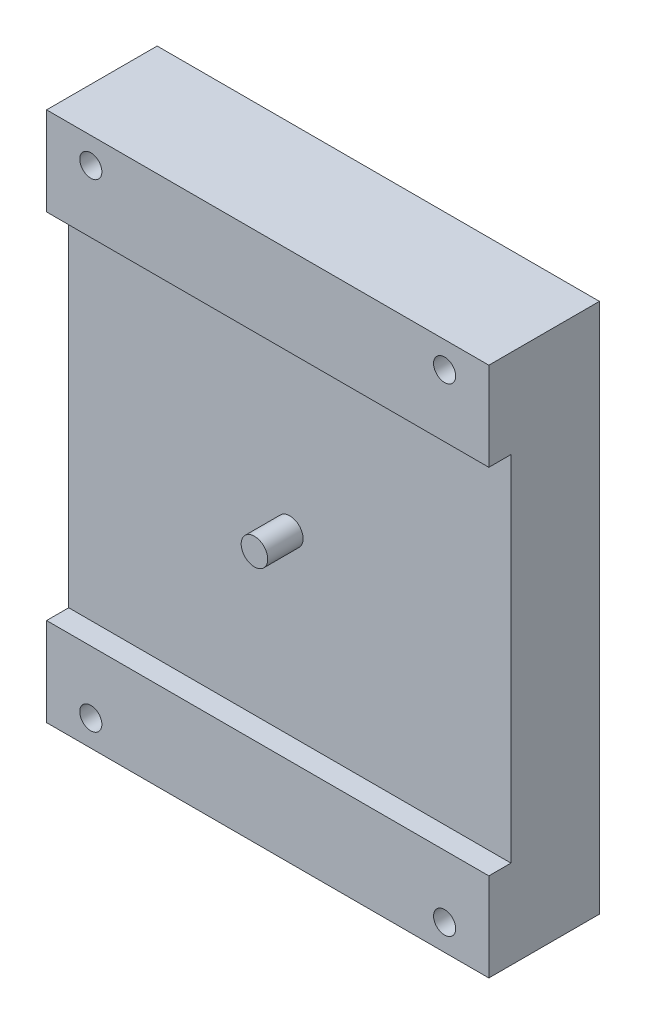
ISO-10303-21;
HEADER;
FILE_DESCRIPTION(('STEP AP214'),'2;1');
FILE_NAME('part.step','',(''),(''),'','','');
FILE_SCHEMA(('AUTOMOTIVE_DESIGN { 1 0 10303 214 1 1 1 1 }'));
ENDSEC;
DATA;
#1=APPLICATION_CONTEXT('core data for automotive mechanical design processes');
#2=APPLICATION_PROTOCOL_DEFINITION('international standard','automotive_design',2000,#1);
#3=PRODUCT_CONTEXT('',#1,'mechanical');
#4=PRODUCT('Part','Part','',(#3));
#5=PRODUCT_RELATED_PRODUCT_CATEGORY('part','',(#4));
#6=PRODUCT_DEFINITION_FORMATION('','',#4);
#7=PRODUCT_DEFINITION_CONTEXT('part definition',#1,'design');
#8=PRODUCT_DEFINITION('design','',#6,#7);
#9=PRODUCT_DEFINITION_SHAPE('','',#8);
#10=(LENGTH_UNIT() NAMED_UNIT(*) SI_UNIT(.MILLI.,.METRE.));
#11=(NAMED_UNIT(*) PLANE_ANGLE_UNIT() SI_UNIT($,.RADIAN.));
#12=(NAMED_UNIT(*) SI_UNIT($,.STERADIAN.) SOLID_ANGLE_UNIT());
#13=UNCERTAINTY_MEASURE_WITH_UNIT(LENGTH_MEASURE(1.E-05),#10,'distance_accuracy_value','');
#14=(GEOMETRIC_REPRESENTATION_CONTEXT(3) GLOBAL_UNCERTAINTY_ASSIGNED_CONTEXT((#13)) GLOBAL_UNIT_ASSIGNED_CONTEXT((#10,
#11,#12)) REPRESENTATION_CONTEXT('',''));
#15=CARTESIAN_POINT('',(0.,0.,0.));
#16=DIRECTION('',(0.,0.,1.));
#17=DIRECTION('',(1.,0.,0.));
#18=AXIS2_PLACEMENT_3D('',#15,#16,#17);
#19=CARTESIAN_POINT('',(0.,0.,10.));
#20=DIRECTION('',(0.,0.,1.));
#21=DIRECTION('',(1.,0.,0.));
#22=AXIS2_PLACEMENT_3D('',#19,#20,#21);
#23=PLANE('',#22);
#24=CARTESIAN_POINT('',(-25.,30.,10.));
#25=DIRECTION('',(0.,0.,1.));
#26=DIRECTION('',(1.,0.,0.));
#27=AXIS2_PLACEMENT_3D('',#24,#25,#26);
#28=CIRCLE('',#27,1.5);
#29=CARTESIAN_POINT('',(-23.5,30.,10.));
#30=VERTEX_POINT('',#29);
#31=EDGE_CURVE('E150',#30,#30,#28,.T.);
#32=ORIENTED_EDGE('',*,*,#31,.F.);
#33=EDGE_LOOP('',(#32));
#34=FACE_BOUND('',#33,.T.);
#35=DIRECTION('',(0.,-1.,0.));
#36=VECTOR('',#35,1.);
#37=CARTESIAN_POINT('',(-50.,0.,10.));
#38=LINE('',#37,#36);
#39=CARTESIAN_POINT('',(-50.,50.,10.));
#40=VERTEX_POINT('',#39);
#41=CARTESIAN_POINT('',(-50.,9.99999999999999,10.));
#42=VERTEX_POINT('',#41);
#43=EDGE_CURVE('E53',#40,#42,#38,.T.);
#44=ORIENTED_EDGE('',*,*,#43,.T.);
#45=DIRECTION('',(-1.,0.,0.));
#46=VECTOR('',#45,1.);
#47=CARTESIAN_POINT('',(0.,10.,10.));
#48=LINE('',#47,#46);
#49=CARTESIAN_POINT('',(0.,10.,10.));
#50=VERTEX_POINT('',#49);
#51=EDGE_CURVE('E48',#50,#42,#48,.T.);
#52=ORIENTED_EDGE('',*,*,#51,.F.);
#53=DIRECTION('',(0.,1.,0.));
#54=VECTOR('',#53,1.);
#55=CARTESIAN_POINT('',(0.,0.,10.));
#56=LINE('',#55,#54);
#57=CARTESIAN_POINT('',(0.,50.,10.));
#58=VERTEX_POINT('',#57);
#59=EDGE_CURVE('E120',#50,#58,#56,.T.);
#60=ORIENTED_EDGE('',*,*,#59,.T.);
#61=DIRECTION('',(1.,0.,0.));
#62=VECTOR('',#61,1.);
#63=CARTESIAN_POINT('',(-50.,50.,10.));
#64=LINE('',#63,#62);
#65=EDGE_CURVE('E131',#40,#58,#64,.T.);
#66=ORIENTED_EDGE('',*,*,#65,.F.);
#67=EDGE_LOOP('',(#44,#52,#60,#66));
#68=FACE_BOUND('',#67,.T.);
#69=ADVANCED_FACE('F33',(#34,#68),#23,.T.);
#70=CARTESIAN_POINT('',(0.,0.,0.));
#71=DIRECTION('',(0.,0.,1.));
#72=DIRECTION('',(1.,0.,0.));
#73=AXIS2_PLACEMENT_3D('',#70,#71,#72);
#74=PLANE('',#73);
#75=DIRECTION('',(0.,1.,0.));
#76=VECTOR('',#75,1.);
#77=CARTESIAN_POINT('',(0.,0.,0.));
#78=LINE('',#77,#76);
#79=CARTESIAN_POINT('',(0.,0.,0.));
#80=VERTEX_POINT('',#79);
#81=CARTESIAN_POINT('',(0.,60.,0.));
#82=VERTEX_POINT('',#81);
#83=EDGE_CURVE('E168',#80,#82,#78,.T.);
#84=ORIENTED_EDGE('',*,*,#83,.F.);
#85=DIRECTION('',(1.,0.,0.));
#86=VECTOR('',#85,1.);
#87=CARTESIAN_POINT('',(0.,0.,0.));
#88=LINE('',#87,#86);
#89=CARTESIAN_POINT('',(-50.,0.,0.));
#90=VERTEX_POINT('',#89);
#91=EDGE_CURVE('E170',#90,#80,#88,.T.);
#92=ORIENTED_EDGE('',*,*,#91,.F.);
#93=DIRECTION('',(0.,-1.,0.));
#94=VECTOR('',#93,1.);
#95=CARTESIAN_POINT('',(-50.,0.,0.));
#96=LINE('',#95,#94);
#97=CARTESIAN_POINT('',(-50.,60.,0.));
#98=VERTEX_POINT('',#97);
#99=EDGE_CURVE('E176',#98,#90,#96,.T.);
#100=ORIENTED_EDGE('',*,*,#99,.F.);
#101=DIRECTION('',(-1.,0.,0.));
#102=VECTOR('',#101,1.);
#103=CARTESIAN_POINT('',(0.,60.,0.));
#104=LINE('',#103,#102);
#105=EDGE_CURVE('E174',#82,#98,#104,.T.);
#106=ORIENTED_EDGE('',*,*,#105,.F.);
#107=EDGE_LOOP('',(#84,#92,#100,#106));
#108=FACE_BOUND('',#107,.T.);
#109=CARTESIAN_POINT('',(-45.,57.05,0.));
#110=DIRECTION('',(0.,0.,1.));
#111=DIRECTION('',(1.,0.,0.));
#112=AXIS2_PLACEMENT_3D('',#109,#110,#111);
#113=CIRCLE('',#112,1.25);
#114=CARTESIAN_POINT('',(-43.75,57.05,0.));
#115=VERTEX_POINT('',#114);
#116=EDGE_CURVE('E165',#115,#115,#113,.T.);
#117=ORIENTED_EDGE('',*,*,#116,.T.);
#118=EDGE_LOOP('',(#117));
#119=FACE_BOUND('',#118,.T.);
#120=CARTESIAN_POINT('',(-5.,57.05,0.));
#121=DIRECTION('',(0.,0.,1.));
#122=DIRECTION('',(1.,0.,0.));
#123=AXIS2_PLACEMENT_3D('',#120,#121,#122);
#124=CIRCLE('',#123,1.25);
#125=CARTESIAN_POINT('',(-3.75,57.05,0.));
#126=VERTEX_POINT('',#125);
#127=EDGE_CURVE('E162',#126,#126,#124,.T.);
#128=ORIENTED_EDGE('',*,*,#127,.T.);
#129=EDGE_LOOP('',(#128));
#130=FACE_BOUND('',#129,.T.);
#131=CARTESIAN_POINT('',(-44.9999999999994,2.94999999999999,0.));
#132=DIRECTION('',(0.,0.,1.));
#133=DIRECTION('',(1.,0.,0.));
#134=AXIS2_PLACEMENT_3D('',#131,#132,#133);
#135=CIRCLE('',#134,1.25);
#136=CARTESIAN_POINT('',(-43.7499999999994,2.94999999999999,0.));
#137=VERTEX_POINT('',#136);
#138=EDGE_CURVE('E159',#137,#137,#135,.T.);
#139=ORIENTED_EDGE('',*,*,#138,.T.);
#140=EDGE_LOOP('',(#139));
#141=FACE_BOUND('',#140,.T.);
#142=CARTESIAN_POINT('',(-4.99999999999944,2.94999999999999,0.));
#143=DIRECTION('',(0.,0.,1.));
#144=DIRECTION('',(1.,0.,0.));
#145=AXIS2_PLACEMENT_3D('',#142,#143,#144);
#146=CIRCLE('',#145,1.25);
#147=CARTESIAN_POINT('',(-3.74999999999944,2.94999999999999,0.));
#148=VERTEX_POINT('',#147);
#149=EDGE_CURVE('E154',#148,#148,#146,.T.);
#150=ORIENTED_EDGE('',*,*,#149,.T.);
#151=EDGE_LOOP('',(#150));
#152=FACE_BOUND('',#151,.T.);
#153=ADVANCED_FACE('F193',(#108,#119,#130,#141,#152),#74,.F.);
#154=CARTESIAN_POINT('',(0.,0.,10.));
#155=DIRECTION('',(-1.,0.,0.));
#156=DIRECTION('',(0.,-1.,0.));
#157=AXIS2_PLACEMENT_3D('',#154,#155,#156);
#158=PLANE('',#157);
#159=ORIENTED_EDGE('',*,*,#83,.T.);
#160=DIRECTION('',(0.,0.,-1.));
#161=VECTOR('',#160,1.);
#162=CARTESIAN_POINT('',(0.,60.,10.));
#163=LINE('',#162,#161);
#164=CARTESIAN_POINT('',(0.,60.,12.5));
#165=VERTEX_POINT('',#164);
#166=EDGE_CURVE('E11',#165,#82,#163,.T.);
#167=ORIENTED_EDGE('',*,*,#166,.F.);
#168=DIRECTION('',(0.,1.,0.));
#169=VECTOR('',#168,1.);
#170=CARTESIAN_POINT('',(0.,60.,12.5));
#171=LINE('',#170,#169);
#172=CARTESIAN_POINT('',(0.,50.,12.5));
#173=VERTEX_POINT('',#172);
#174=EDGE_CURVE('E137',#173,#165,#171,.T.);
#175=ORIENTED_EDGE('',*,*,#174,.F.);
#176=DIRECTION('',(0.,0.,-1.));
#177=VECTOR('',#176,1.);
#178=CARTESIAN_POINT('',(0.,50.,12.5));
#179=LINE('',#178,#177);
#180=EDGE_CURVE('E143',#173,#58,#179,.T.);
#181=ORIENTED_EDGE('',*,*,#180,.T.);
#182=ORIENTED_EDGE('',*,*,#59,.F.);
#183=DIRECTION('',(0.,0.,-1.));
#184=VECTOR('',#183,1.);
#185=CARTESIAN_POINT('',(0.,10.,12.5));
#186=LINE('',#185,#184);
#187=CARTESIAN_POINT('',(0.,10.,12.5));
#188=VERTEX_POINT('',#187);
#189=EDGE_CURVE('E100',#188,#50,#186,.T.);
#190=ORIENTED_EDGE('',*,*,#189,.F.);
#191=DIRECTION('',(0.,1.,0.));
#192=VECTOR('',#191,1.);
#193=CARTESIAN_POINT('',(0.,0.,12.5));
#194=LINE('',#193,#192);
#195=CARTESIAN_POINT('',(0.,0.,12.5));
#196=VERTEX_POINT('',#195);
#197=EDGE_CURVE('E107',#196,#188,#194,.T.);
#198=ORIENTED_EDGE('',*,*,#197,.F.);
#199=DIRECTION('',(0.,0.,-1.));
#200=VECTOR('',#199,1.);
#201=CARTESIAN_POINT('',(0.,0.,10.));
#202=LINE('',#201,#200);
#203=EDGE_CURVE('E172',#196,#80,#202,.T.);
#204=ORIENTED_EDGE('',*,*,#203,.T.);
#205=EDGE_LOOP('',(#159,#167,#175,#181,#182,#190,#198,#204));
#206=FACE_BOUND('',#205,.T.);
#207=ADVANCED_FACE('F35',(#206),#158,.F.);
#208=CARTESIAN_POINT('',(0.,60.,10.));
#209=DIRECTION('',(0.,-1.,0.));
#210=DIRECTION('',(1.,0.,0.));
#211=AXIS2_PLACEMENT_3D('',#208,#209,#210);
#212=PLANE('',#211);
#213=ORIENTED_EDGE('',*,*,#105,.T.);
#214=DIRECTION('',(0.,0.,-1.));
#215=VECTOR('',#214,1.);
#216=CARTESIAN_POINT('',(-50.,60.,10.));
#217=LINE('',#216,#215);
#218=CARTESIAN_POINT('',(-50.,60.,12.5));
#219=VERTEX_POINT('',#218);
#220=EDGE_CURVE('E41',#219,#98,#217,.T.);
#221=ORIENTED_EDGE('',*,*,#220,.F.);
#222=DIRECTION('',(-1.,0.,0.));
#223=VECTOR('',#222,1.);
#224=CARTESIAN_POINT('',(-50.,60.,12.5));
#225=LINE('',#224,#223);
#226=EDGE_CURVE('E140',#165,#219,#225,.T.);
#227=ORIENTED_EDGE('',*,*,#226,.F.);
#228=ORIENTED_EDGE('',*,*,#166,.T.);
#229=EDGE_LOOP('',(#213,#221,#227,#228));
#230=FACE_BOUND('',#229,.T.);
#231=ADVANCED_FACE('F202',(#230),#212,.F.);
#232=CARTESIAN_POINT('',(-50.,0.,10.));
#233=DIRECTION('',(1.,0.,0.));
#234=DIRECTION('',(0.,0.,-1.));
#235=AXIS2_PLACEMENT_3D('',#232,#233,#234);
#236=PLANE('',#235);
#237=ORIENTED_EDGE('',*,*,#99,.T.);
#238=DIRECTION('',(0.,0.,-1.));
#239=VECTOR('',#238,1.);
#240=CARTESIAN_POINT('',(-50.,0.,10.));
#241=LINE('',#240,#239);
#242=CARTESIAN_POINT('',(-50.,0.,12.5));
#243=VERTEX_POINT('',#242);
#244=EDGE_CURVE('E180',#243,#90,#241,.T.);
#245=ORIENTED_EDGE('',*,*,#244,.F.);
#246=DIRECTION('',(0.,-1.,0.));
#247=VECTOR('',#246,1.);
#248=CARTESIAN_POINT('',(-50.,0.,12.5));
#249=LINE('',#248,#247);
#250=CARTESIAN_POINT('',(-50.,9.99999999999999,12.5));
#251=VERTEX_POINT('',#250);
#252=EDGE_CURVE('E106',#251,#243,#249,.T.);
#253=ORIENTED_EDGE('',*,*,#252,.F.);
#254=DIRECTION('',(0.,0.,-1.));
#255=VECTOR('',#254,1.);
#256=CARTESIAN_POINT('',(-50.,9.99999999999999,12.5));
#257=LINE('',#256,#255);
#258=EDGE_CURVE('E102',#251,#42,#257,.T.);
#259=ORIENTED_EDGE('',*,*,#258,.T.);
#260=ORIENTED_EDGE('',*,*,#43,.F.);
#261=DIRECTION('',(0.,0.,-1.));
#262=VECTOR('',#261,1.);
#263=CARTESIAN_POINT('',(-50.,50.,12.5));
#264=LINE('',#263,#262);
#265=CARTESIAN_POINT('',(-50.,50.,12.5));
#266=VERTEX_POINT('',#265);
#267=EDGE_CURVE('E147',#266,#40,#264,.T.);
#268=ORIENTED_EDGE('',*,*,#267,.F.);
#269=DIRECTION('',(0.,-1.,0.));
#270=VECTOR('',#269,1.);
#271=CARTESIAN_POINT('',(-50.,60.,12.5));
#272=LINE('',#271,#270);
#273=EDGE_CURVE('E132',#219,#266,#272,.T.);
#274=ORIENTED_EDGE('',*,*,#273,.F.);
#275=ORIENTED_EDGE('',*,*,#220,.T.);
#276=EDGE_LOOP('',(#237,#245,#253,#259,#260,#268,#274,#275));
#277=FACE_BOUND('',#276,.T.);
#278=ADVANCED_FACE('F186',(#277),#236,.F.);
#279=CARTESIAN_POINT('',(0.,0.,10.));
#280=DIRECTION('',(0.,1.,0.));
#281=DIRECTION('',(-1.,0.,0.));
#282=AXIS2_PLACEMENT_3D('',#279,#280,#281);
#283=PLANE('',#282);
#284=ORIENTED_EDGE('',*,*,#91,.T.);
#285=ORIENTED_EDGE('',*,*,#203,.F.);
#286=DIRECTION('',(1.,0.,0.));
#287=VECTOR('',#286,1.);
#288=CARTESIAN_POINT('',(0.,0.,12.5));
#289=LINE('',#288,#287);
#290=EDGE_CURVE('E114',#243,#196,#289,.T.);
#291=ORIENTED_EDGE('',*,*,#290,.F.);
#292=ORIENTED_EDGE('',*,*,#244,.T.);
#293=EDGE_LOOP('',(#284,#285,#291,#292));
#294=FACE_BOUND('',#293,.T.);
#295=ADVANCED_FACE('F196',(#294),#283,.F.);
#296=CARTESIAN_POINT('',(-45.,57.05,10.));
#297=DIRECTION('',(0.,0.,-1.));
#298=DIRECTION('',(-1.,0.,0.));
#299=AXIS2_PLACEMENT_3D('',#296,#297,#298);
#300=CYLINDRICAL_SURFACE('',#299,1.25);
#301=ORIENTED_EDGE('',*,*,#116,.F.);
#302=EDGE_LOOP('',(#301));
#303=FACE_BOUND('',#302,.T.);
#304=CARTESIAN_POINT('',(-45.,57.05,12.5));
#305=DIRECTION('',(0.,0.,1.));
#306=DIRECTION('',(1.,0.,0.));
#307=AXIS2_PLACEMENT_3D('',#304,#305,#306);
#308=CIRCLE('',#307,1.25);
#309=CARTESIAN_POINT('',(-43.75,57.05,12.5));
#310=VERTEX_POINT('',#309);
#311=EDGE_CURVE('E124',#310,#310,#308,.T.);
#312=ORIENTED_EDGE('',*,*,#311,.T.);
#313=EDGE_LOOP('',(#312));
#314=FACE_BOUND('',#313,.T.);
#315=ADVANCED_FACE('F218',(#303,#314),#300,.F.);
#316=CARTESIAN_POINT('',(-5.,57.05,10.));
#317=DIRECTION('',(0.,0.,-1.));
#318=DIRECTION('',(-1.,0.,0.));
#319=AXIS2_PLACEMENT_3D('',#316,#317,#318);
#320=CYLINDRICAL_SURFACE('',#319,1.25);
#321=ORIENTED_EDGE('',*,*,#127,.F.);
#322=EDGE_LOOP('',(#321));
#323=FACE_BOUND('',#322,.T.);
#324=CARTESIAN_POINT('',(-5.,57.05,12.5));
#325=DIRECTION('',(0.,0.,1.));
#326=DIRECTION('',(1.,0.,0.));
#327=AXIS2_PLACEMENT_3D('',#324,#325,#326);
#328=CIRCLE('',#327,1.25);
#329=CARTESIAN_POINT('',(-3.75,57.05,12.5));
#330=VERTEX_POINT('',#329);
#331=EDGE_CURVE('E121',#330,#330,#328,.T.);
#332=ORIENTED_EDGE('',*,*,#331,.T.);
#333=EDGE_LOOP('',(#332));
#334=FACE_BOUND('',#333,.T.);
#335=ADVANCED_FACE('F225',(#323,#334),#320,.F.);
#336=CARTESIAN_POINT('',(-44.9999999999994,2.94999999999999,10.));
#337=DIRECTION('',(0.,0.,-1.));
#338=DIRECTION('',(-1.,0.,0.));
#339=AXIS2_PLACEMENT_3D('',#336,#337,#338);
#340=CYLINDRICAL_SURFACE('',#339,1.25);
#341=ORIENTED_EDGE('',*,*,#138,.F.);
#342=EDGE_LOOP('',(#341));
#343=FACE_BOUND('',#342,.T.);
#344=CARTESIAN_POINT('',(-44.9999999999994,2.94999999999999,12.5));
#345=DIRECTION('',(0.,0.,1.));
#346=DIRECTION('',(1.,0.,0.));
#347=AXIS2_PLACEMENT_3D('',#344,#345,#346);
#348=CIRCLE('',#347,1.25);
#349=CARTESIAN_POINT('',(-43.7499999999994,2.94999999999999,12.5));
#350=VERTEX_POINT('',#349);
#351=EDGE_CURVE('E267',#350,#350,#348,.T.);
#352=ORIENTED_EDGE('',*,*,#351,.T.);
#353=EDGE_LOOP('',(#352));
#354=FACE_BOUND('',#353,.T.);
#355=ADVANCED_FACE('F230',(#343,#354),#340,.F.);
#356=CARTESIAN_POINT('',(-4.99999999999944,2.94999999999999,10.));
#357=DIRECTION('',(0.,0.,-1.));
#358=DIRECTION('',(-1.,0.,0.));
#359=AXIS2_PLACEMENT_3D('',#356,#357,#358);
#360=CYLINDRICAL_SURFACE('',#359,1.25);
#361=ORIENTED_EDGE('',*,*,#149,.F.);
#362=EDGE_LOOP('',(#361));
#363=FACE_BOUND('',#362,.T.);
#364=CARTESIAN_POINT('',(-4.99999999999944,2.94999999999999,12.5));
#365=DIRECTION('',(0.,0.,1.));
#366=DIRECTION('',(1.,0.,0.));
#367=AXIS2_PLACEMENT_3D('',#364,#365,#366);
#368=CIRCLE('',#367,1.25);
#369=CARTESIAN_POINT('',(-3.74999999999944,2.94999999999999,12.5));
#370=VERTEX_POINT('',#369);
#371=EDGE_CURVE('E269',#370,#370,#368,.T.);
#372=ORIENTED_EDGE('',*,*,#371,.T.);
#373=EDGE_LOOP('',(#372));
#374=FACE_BOUND('',#373,.T.);
#375=ADVANCED_FACE('F254',(#363,#374),#360,.F.);
#376=CARTESIAN_POINT('',(-25.,30.,14.));
#377=DIRECTION('',(0.,0.,-1.));
#378=DIRECTION('',(-1.,0.,0.));
#379=AXIS2_PLACEMENT_3D('',#376,#377,#378);
#380=CYLINDRICAL_SURFACE('',#379,1.5);
#381=CARTESIAN_POINT('',(-25.,30.,14.));
#382=DIRECTION('',(0.,0.,1.));
#383=DIRECTION('',(1.,0.,0.));
#384=AXIS2_PLACEMENT_3D('',#381,#382,#383);
#385=CIRCLE('',#384,1.5);
#386=CARTESIAN_POINT('',(-23.5,30.,14.));
#387=VERTEX_POINT('',#386);
#388=EDGE_CURVE('E151',#387,#387,#385,.T.);
#389=ORIENTED_EDGE('',*,*,#388,.F.);
#390=EDGE_LOOP('',(#389));
#391=FACE_BOUND('',#390,.T.);
#392=ORIENTED_EDGE('',*,*,#31,.T.);
#393=EDGE_LOOP('',(#392));
#394=FACE_BOUND('',#393,.T.);
#395=ADVANCED_FACE('F246',(#391,#394),#380,.T.);
#396=CARTESIAN_POINT('',(-25.,30.,14.));
#397=DIRECTION('',(0.,0.,1.));
#398=DIRECTION('',(1.,0.,0.));
#399=AXIS2_PLACEMENT_3D('',#396,#397,#398);
#400=PLANE('',#399);
#401=ORIENTED_EDGE('',*,*,#388,.T.);
#402=EDGE_LOOP('',(#401));
#403=FACE_BOUND('',#402,.T.);
#404=ADVANCED_FACE('F238',(#403),#400,.T.);
#405=CARTESIAN_POINT('',(0.,0.,12.5));
#406=DIRECTION('',(0.,0.,1.));
#407=DIRECTION('',(1.,0.,0.));
#408=AXIS2_PLACEMENT_3D('',#405,#406,#407);
#409=PLANE('',#408);
#410=ORIENTED_EDGE('',*,*,#311,.F.);
#411=EDGE_LOOP('',(#410));
#412=FACE_BOUND('',#411,.T.);
#413=ORIENTED_EDGE('',*,*,#273,.T.);
#414=DIRECTION('',(1.,0.,0.));
#415=VECTOR('',#414,1.);
#416=CARTESIAN_POINT('',(-50.,50.,12.5));
#417=LINE('',#416,#415);
#418=EDGE_CURVE('E135',#266,#173,#417,.T.);
#419=ORIENTED_EDGE('',*,*,#418,.T.);
#420=ORIENTED_EDGE('',*,*,#174,.T.);
#421=ORIENTED_EDGE('',*,*,#226,.T.);
#422=EDGE_LOOP('',(#413,#419,#420,#421));
#423=FACE_BOUND('',#422,.T.);
#424=ORIENTED_EDGE('',*,*,#331,.F.);
#425=EDGE_LOOP('',(#424));
#426=FACE_BOUND('',#425,.T.);
#427=ADVANCED_FACE('F199',(#412,#423,#426),#409,.T.);
#428=CARTESIAN_POINT('',(-50.,50.,12.5));
#429=DIRECTION('',(0.,1.,0.));
#430=DIRECTION('',(0.,0.,1.));
#431=AXIS2_PLACEMENT_3D('',#428,#429,#430);
#432=PLANE('',#431);
#433=ORIENTED_EDGE('',*,*,#65,.T.);
#434=ORIENTED_EDGE('',*,*,#180,.F.);
#435=ORIENTED_EDGE('',*,*,#418,.F.);
#436=ORIENTED_EDGE('',*,*,#267,.T.);
#437=EDGE_LOOP('',(#433,#434,#435,#436));
#438=FACE_BOUND('',#437,.T.);
#439=ADVANCED_FACE('F237',(#438),#432,.F.);
#440=CARTESIAN_POINT('',(0.,0.,12.5));
#441=DIRECTION('',(0.,0.,1.));
#442=DIRECTION('',(1.,0.,0.));
#443=AXIS2_PLACEMENT_3D('',#440,#441,#442);
#444=PLANE('',#443);
#445=ORIENTED_EDGE('',*,*,#351,.F.);
#446=EDGE_LOOP('',(#445));
#447=FACE_BOUND('',#446,.T.);
#448=ORIENTED_EDGE('',*,*,#197,.T.);
#449=DIRECTION('',(-1.,0.,0.));
#450=VECTOR('',#449,1.);
#451=CARTESIAN_POINT('',(0.,10.,12.5));
#452=LINE('',#451,#450);
#453=EDGE_CURVE('E96',#188,#251,#452,.T.);
#454=ORIENTED_EDGE('',*,*,#453,.T.);
#455=ORIENTED_EDGE('',*,*,#252,.T.);
#456=ORIENTED_EDGE('',*,*,#290,.T.);
#457=EDGE_LOOP('',(#448,#454,#455,#456));
#458=FACE_BOUND('',#457,.T.);
#459=ORIENTED_EDGE('',*,*,#371,.F.);
#460=EDGE_LOOP('',(#459));
#461=FACE_BOUND('',#460,.T.);
#462=ADVANCED_FACE('F111',(#447,#458,#461),#444,.T.);
#463=CARTESIAN_POINT('',(0.,10.,12.5));
#464=DIRECTION('',(0.,-1.,0.));
#465=DIRECTION('',(1.,0.,0.));
#466=AXIS2_PLACEMENT_3D('',#463,#464,#465);
#467=PLANE('',#466);
#468=ORIENTED_EDGE('',*,*,#51,.T.);
#469=ORIENTED_EDGE('',*,*,#258,.F.);
#470=ORIENTED_EDGE('',*,*,#453,.F.);
#471=ORIENTED_EDGE('',*,*,#189,.T.);
#472=EDGE_LOOP('',(#468,#469,#470,#471));
#473=FACE_BOUND('',#472,.T.);
#474=ADVANCED_FACE('F98',(#473),#467,.F.);
#475=CLOSED_SHELL('',(#69,#153,#207,#231,#278,#295,#315,#335,#355,#375,#395,#404,#427,#439,#462,#474));
#476=MANIFOLD_SOLID_BREP('B2',#475);
#477=ADVANCED_BREP_SHAPE_REPRESENTATION('',(#18,#476),#14);
#478=SHAPE_DEFINITION_REPRESENTATION(#9,#477);
ENDSEC;
END-ISO-10303-21;
